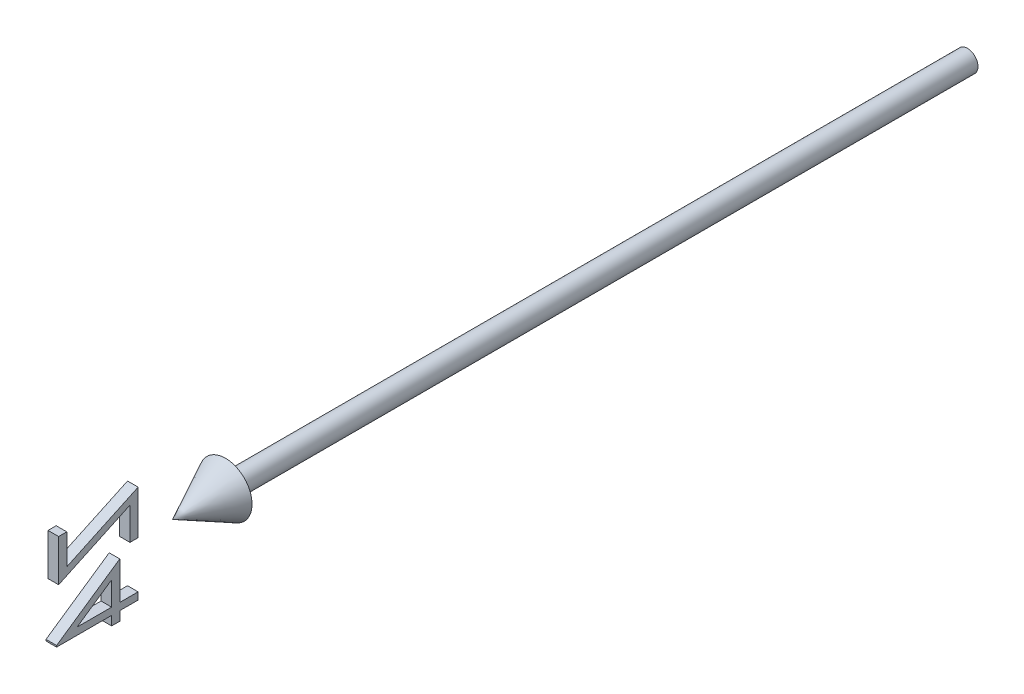
ISO-10303-21;
HEADER;
FILE_DESCRIPTION(('STEP AP214'),'2;1');
FILE_NAME('part.step','',(''),(''),'','','');
FILE_SCHEMA(('AUTOMOTIVE_DESIGN { 1 0 10303 214 1 1 1 1 }'));
ENDSEC;
DATA;
#1=APPLICATION_CONTEXT('core data for automotive mechanical design processes');
#2=APPLICATION_PROTOCOL_DEFINITION('international standard','automotive_design',2000,#1);
#3=PRODUCT_CONTEXT('',#1,'mechanical');
#4=PRODUCT('Part','Part','',(#3));
#5=PRODUCT_RELATED_PRODUCT_CATEGORY('part','',(#4));
#6=PRODUCT_DEFINITION_FORMATION('','',#4);
#7=PRODUCT_DEFINITION_CONTEXT('part definition',#1,'design');
#8=PRODUCT_DEFINITION('design','',#6,#7);
#9=PRODUCT_DEFINITION_SHAPE('','',#8);
#10=(LENGTH_UNIT() NAMED_UNIT(*) SI_UNIT(.MILLI.,.METRE.));
#11=(NAMED_UNIT(*) PLANE_ANGLE_UNIT() SI_UNIT($,.RADIAN.));
#12=(NAMED_UNIT(*) SI_UNIT($,.STERADIAN.) SOLID_ANGLE_UNIT());
#13=UNCERTAINTY_MEASURE_WITH_UNIT(LENGTH_MEASURE(1.E-05),#10,'distance_accuracy_value','');
#14=(GEOMETRIC_REPRESENTATION_CONTEXT(3) GLOBAL_UNCERTAINTY_ASSIGNED_CONTEXT((#13)) GLOBAL_UNIT_ASSIGNED_CONTEXT((#10,
#11,#12)) REPRESENTATION_CONTEXT('',''));
#15=CARTESIAN_POINT('',(0.,0.,0.));
#16=DIRECTION('',(0.,0.,1.));
#17=DIRECTION('',(1.,0.,0.));
#18=AXIS2_PLACEMENT_3D('',#15,#16,#17);
#19=CARTESIAN_POINT('',(1.00000000000002,-0.464490401758508,160.961538461538));
#20=DIRECTION('',(0.,-0.824332768950697,-0.566105543193208));
#21=DIRECTION('',(0.,0.566105543193208,-0.824332768950697));
#22=AXIS2_PLACEMENT_3D('',#19,#20,#21);
#23=PLANE('',#22);
#24=DIRECTION('',(-1.,0.,0.));
#25=VECTOR('',#24,1.);
#26=CARTESIAN_POINT('',(1.00000000000002,-0.464490401758508,160.961538461538));
#27=LINE('',#26,#25);
#28=CARTESIAN_POINT('',(1.00000000000002,-0.464490401758508,160.961538461538));
#29=VERTEX_POINT('',#28);
#30=CARTESIAN_POINT('',(-0.999999999999976,-0.464490401758508,160.961538461538));
#31=VERTEX_POINT('',#30);
#32=EDGE_CURVE('E220',#29,#31,#27,.T.);
#33=ORIENTED_EDGE('',*,*,#32,.T.);
#34=DIRECTION('',(0.,-0.566105543193208,0.824332768950697));
#35=VECTOR('',#34,1.);
#36=CARTESIAN_POINT('',(-0.999999999999976,-0.464490401758508,160.961538461538));
#37=LINE('',#36,#35);
#38=CARTESIAN_POINT('',(-0.999999999999893,-8.65259136329697,172.884615384615));
#39=VERTEX_POINT('',#38);
#40=EDGE_CURVE('E163',#31,#39,#37,.T.);
#41=ORIENTED_EDGE('',*,*,#40,.T.);
#42=DIRECTION('',(-1.,0.,0.));
#43=VECTOR('',#42,1.);
#44=CARTESIAN_POINT('',(1.00000000000011,-8.65259136329697,172.884615384615));
#45=LINE('',#44,#43);
#46=CARTESIAN_POINT('',(1.00000000000011,-8.65259136329697,172.884615384615));
#47=VERTEX_POINT('',#46);
#48=EDGE_CURVE('E12',#47,#39,#45,.T.);
#49=ORIENTED_EDGE('',*,*,#48,.F.);
#50=DIRECTION('',(0.,-0.566105543193208,0.824332768950697));
#51=VECTOR('',#50,1.);
#52=CARTESIAN_POINT('',(1.00000000000002,-0.464490401758508,160.961538461538));
#53=LINE('',#52,#51);
#54=EDGE_CURVE('E200',#29,#47,#53,.T.);
#55=ORIENTED_EDGE('',*,*,#54,.F.);
#56=EDGE_LOOP('',(#33,#41,#49,#55));
#57=FACE_BOUND('',#56,.T.);
#58=ADVANCED_FACE('F46',(#57),#23,.F.);
#59=CARTESIAN_POINT('',(1.00000000000011,-8.65259136329697,172.884615384615));
#60=DIRECTION('',(0.,0.,-1.));
#61=DIRECTION('',(-1.,0.,0.));
#62=AXIS2_PLACEMENT_3D('',#59,#60,#61);
#63=PLANE('',#62);
#64=ORIENTED_EDGE('',*,*,#48,.T.);
#65=DIRECTION('',(0.,-1.,0.));
#66=VECTOR('',#65,1.);
#67=CARTESIAN_POINT('',(-0.999999999999893,-8.65259136329697,172.884615384615));
#68=LINE('',#67,#66);
#69=CARTESIAN_POINT('',(-0.999999999999893,-8.92602886329697,172.884615384615));
#70=VERTEX_POINT('',#69);
#71=EDGE_CURVE('E168',#39,#70,#68,.T.);
#72=ORIENTED_EDGE('',*,*,#71,.T.);
#73=DIRECTION('',(-1.,0.,0.));
#74=VECTOR('',#73,1.);
#75=CARTESIAN_POINT('',(1.00000000000011,-8.92602886329697,172.884615384615));
#76=LINE('',#75,#74);
#77=CARTESIAN_POINT('',(1.00000000000011,-8.92602886329697,172.884615384615));
#78=VERTEX_POINT('',#77);
#79=EDGE_CURVE('E53',#78,#70,#76,.T.);
#80=ORIENTED_EDGE('',*,*,#79,.F.);
#81=DIRECTION('',(0.,-1.,0.));
#82=VECTOR('',#81,1.);
#83=CARTESIAN_POINT('',(1.00000000000011,-8.65259136329697,172.884615384615));
#84=LINE('',#83,#82);
#85=EDGE_CURVE('E203',#47,#78,#84,.T.);
#86=ORIENTED_EDGE('',*,*,#85,.F.);
#87=EDGE_LOOP('',(#64,#72,#80,#86));
#88=FACE_BOUND('',#87,.T.);
#89=ADVANCED_FACE('F247',(#88),#63,.F.);
#90=CARTESIAN_POINT('',(1.00000000000011,-8.92602886329697,172.884615384615));
#91=DIRECTION('',(0.,1.,0.));
#92=DIRECTION('',(0.,0.,1.));
#93=AXIS2_PLACEMENT_3D('',#90,#91,#92);
#94=PLANE('',#93);
#95=ORIENTED_EDGE('',*,*,#79,.T.);
#96=DIRECTION('',(0.,0.,-1.));
#97=VECTOR('',#96,1.);
#98=CARTESIAN_POINT('',(-0.999999999999893,-8.92602886329697,172.884615384615));
#99=LINE('',#98,#97);
#100=CARTESIAN_POINT('',(-0.999999999999965,-8.92602886329697,162.5));
#101=VERTEX_POINT('',#100);
#102=EDGE_CURVE('E171',#70,#101,#99,.T.);
#103=ORIENTED_EDGE('',*,*,#102,.T.);
#104=DIRECTION('',(-1.,0.,0.));
#105=VECTOR('',#104,1.);
#106=CARTESIAN_POINT('',(1.00000000000003,-8.92602886329697,162.5));
#107=LINE('',#106,#105);
#108=CARTESIAN_POINT('',(1.00000000000003,-8.92602886329697,162.5));
#109=VERTEX_POINT('',#108);
#110=EDGE_CURVE('E234',#109,#101,#107,.T.);
#111=ORIENTED_EDGE('',*,*,#110,.F.);
#112=DIRECTION('',(0.,0.,-1.));
#113=VECTOR('',#112,1.);
#114=CARTESIAN_POINT('',(1.00000000000011,-8.92602886329697,172.884615384615));
#115=LINE('',#114,#113);
#116=EDGE_CURVE('E205',#78,#109,#115,.T.);
#117=ORIENTED_EDGE('',*,*,#116,.F.);
#118=EDGE_LOOP('',(#95,#103,#111,#117));
#119=FACE_BOUND('',#118,.T.);
#120=ADVANCED_FACE('F239',(#119),#94,.F.);
#121=CARTESIAN_POINT('',(1.00000000000003,-8.92602886329697,162.5));
#122=DIRECTION('',(0.,0.,-1.));
#123=DIRECTION('',(-1.,0.,0.));
#124=AXIS2_PLACEMENT_3D('',#121,#122,#123);
#125=PLANE('',#124);
#126=ORIENTED_EDGE('',*,*,#110,.T.);
#127=DIRECTION('',(0.,-1.,0.));
#128=VECTOR('',#127,1.);
#129=CARTESIAN_POINT('',(-0.999999999999965,-8.92602886329697,162.5));
#130=LINE('',#129,#128);
#131=CARTESIAN_POINT('',(-0.999999999999965,-10.6567980940662,162.5));
#132=VERTEX_POINT('',#131);
#133=EDGE_CURVE('E174',#101,#132,#130,.T.);
#134=ORIENTED_EDGE('',*,*,#133,.T.);
#135=DIRECTION('',(-1.,0.,0.));
#136=VECTOR('',#135,1.);
#137=CARTESIAN_POINT('',(1.00000000000003,-10.6567980940662,162.5));
#138=LINE('',#137,#136);
#139=CARTESIAN_POINT('',(1.00000000000003,-10.6567980940662,162.5));
#140=VERTEX_POINT('',#139);
#141=EDGE_CURVE('E232',#140,#132,#138,.T.);
#142=ORIENTED_EDGE('',*,*,#141,.F.);
#143=DIRECTION('',(0.,-1.,0.));
#144=VECTOR('',#143,1.);
#145=CARTESIAN_POINT('',(1.00000000000003,-8.92602886329697,162.5));
#146=LINE('',#145,#144);
#147=EDGE_CURVE('E207',#109,#140,#146,.T.);
#148=ORIENTED_EDGE('',*,*,#147,.F.);
#149=EDGE_LOOP('',(#126,#134,#142,#148));
#150=FACE_BOUND('',#149,.T.);
#151=ADVANCED_FACE('F280',(#150),#125,.F.);
#152=CARTESIAN_POINT('',(1.00000000000003,-10.6567980940662,162.5));
#153=DIRECTION('',(0.,1.,0.));
#154=DIRECTION('',(0.,0.,1.));
#155=AXIS2_PLACEMENT_3D('',#152,#153,#154);
#156=PLANE('',#155);
#157=ORIENTED_EDGE('',*,*,#141,.T.);
#158=DIRECTION('',(0.,0.,-1.));
#159=VECTOR('',#158,1.);
#160=CARTESIAN_POINT('',(-0.999999999999965,-10.6567980940662,162.5));
#161=LINE('',#160,#159);
#162=CARTESIAN_POINT('',(-0.999999999999976,-10.6567980940662,160.961538461538));
#163=VERTEX_POINT('',#162);
#164=EDGE_CURVE('E177',#132,#163,#161,.T.);
#165=ORIENTED_EDGE('',*,*,#164,.T.);
#166=DIRECTION('',(-1.,0.,0.));
#167=VECTOR('',#166,1.);
#168=CARTESIAN_POINT('',(1.00000000000002,-10.6567980940662,160.961538461538));
#169=LINE('',#168,#167);
#170=CARTESIAN_POINT('',(1.00000000000002,-10.6567980940662,160.961538461538));
#171=VERTEX_POINT('',#170);
#172=EDGE_CURVE('E230',#171,#163,#169,.T.);
#173=ORIENTED_EDGE('',*,*,#172,.F.);
#174=DIRECTION('',(0.,0.,-1.));
#175=VECTOR('',#174,1.);
#176=CARTESIAN_POINT('',(1.00000000000003,-10.6567980940662,162.5));
#177=LINE('',#176,#175);
#178=EDGE_CURVE('E209',#140,#171,#177,.T.);
#179=ORIENTED_EDGE('',*,*,#178,.F.);
#180=EDGE_LOOP('',(#157,#165,#173,#179));
#181=FACE_BOUND('',#180,.T.);
#182=ADVANCED_FACE('F277',(#181),#156,.F.);
#183=CARTESIAN_POINT('',(1.00000000000002,-10.6567980940662,160.961538461538));
#184=DIRECTION('',(0.,0.,1.));
#185=DIRECTION('',(1.,0.,0.));
#186=AXIS2_PLACEMENT_3D('',#183,#184,#185);
#187=PLANE('',#186);
#188=ORIENTED_EDGE('',*,*,#172,.T.);
#189=DIRECTION('',(0.,1.,0.));
#190=VECTOR('',#189,1.);
#191=CARTESIAN_POINT('',(-0.999999999999976,-10.6567980940662,160.961538461538));
#192=LINE('',#191,#190);
#193=CARTESIAN_POINT('',(-0.999999999999976,-8.92602886329697,160.961538461538));
#194=VERTEX_POINT('',#193);
#195=EDGE_CURVE('E180',#163,#194,#192,.T.);
#196=ORIENTED_EDGE('',*,*,#195,.T.);
#197=DIRECTION('',(-1.,0.,0.));
#198=VECTOR('',#197,1.);
#199=CARTESIAN_POINT('',(1.00000000000002,-8.92602886329697,160.961538461538));
#200=LINE('',#199,#198);
#201=CARTESIAN_POINT('',(1.00000000000002,-8.92602886329697,160.961538461538));
#202=VERTEX_POINT('',#201);
#203=EDGE_CURVE('E228',#202,#194,#200,.T.);
#204=ORIENTED_EDGE('',*,*,#203,.F.);
#205=DIRECTION('',(0.,1.,0.));
#206=VECTOR('',#205,1.);
#207=CARTESIAN_POINT('',(1.00000000000002,-10.6567980940662,160.961538461538));
#208=LINE('',#207,#206);
#209=EDGE_CURVE('E211',#171,#202,#208,.T.);
#210=ORIENTED_EDGE('',*,*,#209,.F.);
#211=EDGE_LOOP('',(#188,#196,#204,#210));
#212=FACE_BOUND('',#211,.T.);
#213=ADVANCED_FACE('F272',(#212),#187,.F.);
#214=CARTESIAN_POINT('',(1.00000000000002,-8.92602886329697,160.961538461538));
#215=DIRECTION('',(0.,1.,0.));
#216=DIRECTION('',(0.,0.,1.));
#217=AXIS2_PLACEMENT_3D('',#214,#215,#216);
#218=PLANE('',#217);
#219=ORIENTED_EDGE('',*,*,#203,.T.);
#220=DIRECTION('',(0.,0.,-1.));
#221=VECTOR('',#220,1.);
#222=CARTESIAN_POINT('',(-0.999999999999976,-8.92602886329697,160.961538461538));
#223=LINE('',#222,#221);
#224=CARTESIAN_POINT('',(-1.,-8.92602886329697,157.5));
#225=VERTEX_POINT('',#224);
#226=EDGE_CURVE('E183',#194,#225,#223,.T.);
#227=ORIENTED_EDGE('',*,*,#226,.T.);
#228=DIRECTION('',(-1.,0.,0.));
#229=VECTOR('',#228,1.);
#230=CARTESIAN_POINT('',(1.,-8.92602886329697,157.5));
#231=LINE('',#230,#229);
#232=CARTESIAN_POINT('',(1.,-8.92602886329697,157.5));
#233=VERTEX_POINT('',#232);
#234=EDGE_CURVE('E226',#233,#225,#231,.T.);
#235=ORIENTED_EDGE('',*,*,#234,.F.);
#236=DIRECTION('',(0.,0.,-1.));
#237=VECTOR('',#236,1.);
#238=CARTESIAN_POINT('',(1.00000000000002,-8.92602886329697,160.961538461538));
#239=LINE('',#238,#237);
#240=EDGE_CURVE('E213',#202,#233,#239,.T.);
#241=ORIENTED_EDGE('',*,*,#240,.F.);
#242=EDGE_LOOP('',(#219,#227,#235,#241));
#243=FACE_BOUND('',#242,.T.);
#244=ADVANCED_FACE('F268',(#243),#218,.F.);
#245=CARTESIAN_POINT('',(1.,-8.92602886329697,157.5));
#246=DIRECTION('',(0.,0.,1.));
#247=DIRECTION('',(1.,0.,0.));
#248=AXIS2_PLACEMENT_3D('',#245,#246,#247);
#249=PLANE('',#248);
#250=ORIENTED_EDGE('',*,*,#234,.T.);
#251=DIRECTION('',(0.,1.,0.));
#252=VECTOR('',#251,1.);
#253=CARTESIAN_POINT('',(-1.,-8.92602886329697,157.5));
#254=LINE('',#253,#252);
#255=CARTESIAN_POINT('',(-1.,-7.57987501714312,157.5));
#256=VERTEX_POINT('',#255);
#257=EDGE_CURVE('E186',#225,#256,#254,.T.);
#258=ORIENTED_EDGE('',*,*,#257,.T.);
#259=DIRECTION('',(-1.,0.,0.));
#260=VECTOR('',#259,1.);
#261=CARTESIAN_POINT('',(1.,-7.57987501714312,157.5));
#262=LINE('',#261,#260);
#263=CARTESIAN_POINT('',(1.,-7.57987501714312,157.5));
#264=VERTEX_POINT('',#263);
#265=EDGE_CURVE('E224',#264,#256,#262,.T.);
#266=ORIENTED_EDGE('',*,*,#265,.F.);
#267=DIRECTION('',(0.,1.,0.));
#268=VECTOR('',#267,1.);
#269=CARTESIAN_POINT('',(1.,-8.92602886329697,157.5));
#270=LINE('',#269,#268);
#271=EDGE_CURVE('E215',#233,#264,#270,.T.);
#272=ORIENTED_EDGE('',*,*,#271,.F.);
#273=EDGE_LOOP('',(#250,#258,#266,#272));
#274=FACE_BOUND('',#273,.T.);
#275=ADVANCED_FACE('F263',(#274),#249,.F.);
#276=CARTESIAN_POINT('',(1.,-7.57987501714312,157.5));
#277=DIRECTION('',(0.,-1.,0.));
#278=DIRECTION('',(0.,0.,-1.));
#279=AXIS2_PLACEMENT_3D('',#276,#277,#278);
#280=PLANE('',#279);
#281=ORIENTED_EDGE('',*,*,#265,.T.);
#282=DIRECTION('',(0.,0.,1.));
#283=VECTOR('',#282,1.);
#284=CARTESIAN_POINT('',(-1.,-7.57987501714312,157.5));
#285=LINE('',#284,#283);
#286=CARTESIAN_POINT('',(-0.999999999999976,-7.57987501714312,160.961538461538));
#287=VERTEX_POINT('',#286);
#288=EDGE_CURVE('E189',#256,#287,#285,.T.);
#289=ORIENTED_EDGE('',*,*,#288,.T.);
#290=DIRECTION('',(-1.,0.,0.));
#291=VECTOR('',#290,1.);
#292=CARTESIAN_POINT('',(1.00000000000002,-7.57987501714312,160.961538461538));
#293=LINE('',#292,#291);
#294=CARTESIAN_POINT('',(1.00000000000002,-7.57987501714312,160.961538461538));
#295=VERTEX_POINT('',#294);
#296=EDGE_CURVE('E222',#295,#287,#293,.T.);
#297=ORIENTED_EDGE('',*,*,#296,.F.);
#298=DIRECTION('',(0.,0.,1.));
#299=VECTOR('',#298,1.);
#300=CARTESIAN_POINT('',(1.,-7.57987501714312,157.5));
#301=LINE('',#300,#299);
#302=EDGE_CURVE('E217',#264,#295,#301,.T.);
#303=ORIENTED_EDGE('',*,*,#302,.F.);
#304=EDGE_LOOP('',(#281,#289,#297,#303));
#305=FACE_BOUND('',#304,.T.);
#306=ADVANCED_FACE('F258',(#305),#280,.F.);
#307=CARTESIAN_POINT('',(1.00000000000002,-7.57987501714312,160.961538461538));
#308=DIRECTION('',(0.,0.,1.));
#309=DIRECTION('',(1.,0.,0.));
#310=AXIS2_PLACEMENT_3D('',#307,#308,#309);
#311=PLANE('',#310);
#312=ORIENTED_EDGE('',*,*,#296,.T.);
#313=DIRECTION('',(0.,1.,0.));
#314=VECTOR('',#313,1.);
#315=CARTESIAN_POINT('',(-0.999999999999976,-7.57987501714312,160.961538461538));
#316=LINE('',#315,#314);
#317=EDGE_CURVE('E192',#287,#31,#316,.T.);
#318=ORIENTED_EDGE('',*,*,#317,.T.);
#319=ORIENTED_EDGE('',*,*,#32,.F.);
#320=DIRECTION('',(0.,1.,0.));
#321=VECTOR('',#320,1.);
#322=CARTESIAN_POINT('',(1.00000000000002,-7.57987501714312,160.961538461538));
#323=LINE('',#322,#321);
#324=EDGE_CURVE('E68',#295,#29,#323,.T.);
#325=ORIENTED_EDGE('',*,*,#324,.F.);
#326=EDGE_LOOP('',(#312,#318,#319,#325));
#327=FACE_BOUND('',#326,.T.);
#328=ADVANCED_FACE('F254',(#327),#311,.F.);
#329=CARTESIAN_POINT('',(0.9999999999989,0.,0.));
#330=DIRECTION('',(1.,0.,0.));
#331=DIRECTION('',(0.,0.,-1.));
#332=AXIS2_PLACEMENT_3D('',#329,#330,#331);
#333=PLANE('',#332);
#334=DIRECTION('',(0.,-1.,0.));
#335=VECTOR('',#334,1.);
#336=CARTESIAN_POINT('',(1.00000000000003,-3.10872117098928,162.5));
#337=LINE('',#336,#335);
#338=CARTESIAN_POINT('',(1.00000000000003,-3.10872117098928,162.5));
#339=VERTEX_POINT('',#338);
#340=CARTESIAN_POINT('',(1.00000000000003,-7.57987501714312,162.5));
#341=VERTEX_POINT('',#340);
#342=EDGE_CURVE('E195',#339,#341,#337,.T.);
#343=ORIENTED_EDGE('',*,*,#342,.T.);
#344=DIRECTION('',(0.,0.,1.));
#345=VECTOR('',#344,1.);
#346=CARTESIAN_POINT('',(1.00000000000003,-7.57987501714312,162.5));
#347=LINE('',#346,#345);
#348=CARTESIAN_POINT('',(1.00000000000008,-7.57987501714312,169.014423076923));
#349=VERTEX_POINT('',#348);
#350=EDGE_CURVE('E147',#341,#349,#347,.T.);
#351=ORIENTED_EDGE('',*,*,#350,.T.);
#352=DIRECTION('',(0.,0.565883050718715,-0.82448552013318));
#353=VECTOR('',#352,1.);
#354=CARTESIAN_POINT('',(1.00000000000008,-7.57987501714312,169.014423076923));
#355=LINE('',#354,#353);
#356=EDGE_CURVE('E60',#349,#339,#355,.T.);
#357=ORIENTED_EDGE('',*,*,#356,.T.);
#358=EDGE_LOOP('',(#343,#351,#357));
#359=FACE_BOUND('',#358,.T.);
#360=ORIENTED_EDGE('',*,*,#54,.T.);
#361=ORIENTED_EDGE('',*,*,#85,.T.);
#362=ORIENTED_EDGE('',*,*,#116,.T.);
#363=ORIENTED_EDGE('',*,*,#147,.T.);
#364=ORIENTED_EDGE('',*,*,#178,.T.);
#365=ORIENTED_EDGE('',*,*,#209,.T.);
#366=ORIENTED_EDGE('',*,*,#240,.T.);
#367=ORIENTED_EDGE('',*,*,#271,.T.);
#368=ORIENTED_EDGE('',*,*,#302,.T.);
#369=ORIENTED_EDGE('',*,*,#324,.T.);
#370=EDGE_LOOP('',(#360,#361,#362,#363,#364,#365,#366,#367,#368,#369));
#371=FACE_BOUND('',#370,.T.);
#372=ADVANCED_FACE('F282',(#359,#371),#333,.T.);
#373=CARTESIAN_POINT('',(1.00000000000003,-3.10872117098928,162.5));
#374=DIRECTION('',(0.,0.,-1.));
#375=DIRECTION('',(-1.,0.,0.));
#376=AXIS2_PLACEMENT_3D('',#373,#374,#375);
#377=PLANE('',#376);
#378=DIRECTION('',(-1.,0.,0.));
#379=VECTOR('',#378,1.);
#380=CARTESIAN_POINT('',(1.00000000000003,-3.10872117098928,162.5));
#381=LINE('',#380,#379);
#382=CARTESIAN_POINT('',(-0.999999999999965,-3.10872117098928,162.5));
#383=VERTEX_POINT('',#382);
#384=EDGE_CURVE('E156',#339,#383,#381,.T.);
#385=ORIENTED_EDGE('',*,*,#384,.T.);
#386=DIRECTION('',(0.,-1.,0.));
#387=VECTOR('',#386,1.);
#388=CARTESIAN_POINT('',(-0.999999999999965,-3.10872117098928,162.5));
#389=LINE('',#388,#387);
#390=CARTESIAN_POINT('',(-0.999999999999965,-7.57987501714312,162.5));
#391=VERTEX_POINT('',#390);
#392=EDGE_CURVE('E154',#383,#391,#389,.T.);
#393=ORIENTED_EDGE('',*,*,#392,.T.);
#394=DIRECTION('',(-1.,0.,0.));
#395=VECTOR('',#394,1.);
#396=CARTESIAN_POINT('',(1.00000000000003,-7.57987501714312,162.5));
#397=LINE('',#396,#395);
#398=EDGE_CURVE('E140',#341,#391,#397,.T.);
#399=ORIENTED_EDGE('',*,*,#398,.F.);
#400=ORIENTED_EDGE('',*,*,#342,.F.);
#401=EDGE_LOOP('',(#385,#393,#399,#400));
#402=FACE_BOUND('',#401,.T.);
#403=ADVANCED_FACE('F155',(#402),#377,.F.);
#404=CARTESIAN_POINT('',(1.00000000000008,-7.57987501714312,169.014423076923));
#405=DIRECTION('',(0.,0.82448552013318,0.565883050718715));
#406=DIRECTION('',(0.,-0.565883050718715,0.82448552013318));
#407=AXIS2_PLACEMENT_3D('',#404,#405,#406);
#408=PLANE('',#407);
#409=DIRECTION('',(-1.,0.,0.));
#410=VECTOR('',#409,1.);
#411=CARTESIAN_POINT('',(1.00000000000008,-7.57987501714312,169.014423076923));
#412=LINE('',#411,#410);
#413=CARTESIAN_POINT('',(-0.99999999999992,-7.57987501714312,169.014423076923));
#414=VERTEX_POINT('',#413);
#415=EDGE_CURVE('E151',#349,#414,#412,.T.);
#416=ORIENTED_EDGE('',*,*,#415,.T.);
#417=DIRECTION('',(0.,0.565883050718715,-0.82448552013318));
#418=VECTOR('',#417,1.);
#419=CARTESIAN_POINT('',(-0.99999999999992,-7.57987501714312,169.014423076923));
#420=LINE('',#419,#418);
#421=EDGE_CURVE('E161',#414,#383,#420,.T.);
#422=ORIENTED_EDGE('',*,*,#421,.T.);
#423=ORIENTED_EDGE('',*,*,#384,.F.);
#424=ORIENTED_EDGE('',*,*,#356,.F.);
#425=EDGE_LOOP('',(#416,#422,#423,#424));
#426=FACE_BOUND('',#425,.T.);
#427=ADVANCED_FACE('F290',(#426),#408,.F.);
#428=CARTESIAN_POINT('',(1.00000000000003,-7.57987501714312,162.5));
#429=DIRECTION('',(0.,-1.,0.));
#430=DIRECTION('',(0.,0.,-1.));
#431=AXIS2_PLACEMENT_3D('',#428,#429,#430);
#432=PLANE('',#431);
#433=ORIENTED_EDGE('',*,*,#398,.T.);
#434=DIRECTION('',(0.,0.,1.));
#435=VECTOR('',#434,1.);
#436=CARTESIAN_POINT('',(-0.999999999999965,-7.57987501714312,162.5));
#437=LINE('',#436,#435);
#438=EDGE_CURVE('E144',#391,#414,#437,.T.);
#439=ORIENTED_EDGE('',*,*,#438,.T.);
#440=ORIENTED_EDGE('',*,*,#415,.F.);
#441=ORIENTED_EDGE('',*,*,#350,.F.);
#442=EDGE_LOOP('',(#433,#439,#440,#441));
#443=FACE_BOUND('',#442,.T.);
#444=ADVANCED_FACE('F142',(#443),#432,.F.);
#445=CARTESIAN_POINT('',(-1.0000000000011,0.,0.));
#446=DIRECTION('',(1.,0.,0.));
#447=DIRECTION('',(0.,0.,-1.));
#448=AXIS2_PLACEMENT_3D('',#445,#446,#447);
#449=PLANE('',#448);
#450=ORIENTED_EDGE('',*,*,#40,.F.);
#451=ORIENTED_EDGE('',*,*,#317,.F.);
#452=ORIENTED_EDGE('',*,*,#288,.F.);
#453=ORIENTED_EDGE('',*,*,#257,.F.);
#454=ORIENTED_EDGE('',*,*,#226,.F.);
#455=ORIENTED_EDGE('',*,*,#195,.F.);
#456=ORIENTED_EDGE('',*,*,#164,.F.);
#457=ORIENTED_EDGE('',*,*,#133,.F.);
#458=ORIENTED_EDGE('',*,*,#102,.F.);
#459=ORIENTED_EDGE('',*,*,#71,.F.);
#460=EDGE_LOOP('',(#450,#451,#452,#453,#454,#455,#456,#457,#458,#459));
#461=FACE_BOUND('',#460,.T.);
#462=ORIENTED_EDGE('',*,*,#392,.F.);
#463=ORIENTED_EDGE('',*,*,#421,.F.);
#464=ORIENTED_EDGE('',*,*,#438,.F.);
#465=EDGE_LOOP('',(#462,#463,#464));
#466=FACE_BOUND('',#465,.T.);
#467=ADVANCED_FACE('F160',(#461,#466),#449,.F.);
#468=CLOSED_SHELL('',(#58,#89,#120,#151,#182,#213,#244,#275,#306,#328,#372,#403,#427,#444,#467));
#469=MANIFOLD_SOLID_BREP('B2',#468);
#470=CARTESIAN_POINT('',(1.00000000000009,3.24344229054918,170.961538461538));
#471=DIRECTION('',(0.,0.,1.));
#472=DIRECTION('',(1.,0.,0.));
#473=AXIS2_PLACEMENT_3D('',#470,#471,#472);
#474=PLANE('',#473);
#475=DIRECTION('',(-1.,0.,0.));
#476=VECTOR('',#475,1.);
#477=CARTESIAN_POINT('',(1.00000000000009,3.24344229054918,170.961538461538));
#478=LINE('',#477,#476);
#479=CARTESIAN_POINT('',(1.00000000000009,3.24344229054918,170.961538461538));
#480=VERTEX_POINT('',#479);
#481=CARTESIAN_POINT('',(-0.999999999999906,3.24344229054918,170.961538461538));
#482=VERTEX_POINT('',#481);
#483=EDGE_CURVE('E503',#480,#482,#478,.T.);
#484=ORIENTED_EDGE('',*,*,#483,.T.);
#485=DIRECTION('',(0.,1.,0.));
#486=VECTOR('',#485,1.);
#487=CARTESIAN_POINT('',(-0.999999999999906,3.24344229054918,170.961538461538));
#488=LINE('',#487,#486);
#489=CARTESIAN_POINT('',(-0.999999999999906,8.95858652131841,170.961538461538));
#490=VERTEX_POINT('',#489);
#491=EDGE_CURVE('E497',#482,#490,#488,.T.);
#492=ORIENTED_EDGE('',*,*,#491,.T.);
#493=DIRECTION('',(-1.,0.,0.));
#494=VECTOR('',#493,1.);
#495=CARTESIAN_POINT('',(1.00000000000009,8.95858652131841,170.961538461538));
#496=LINE('',#495,#494);
#497=CARTESIAN_POINT('',(1.00000000000009,8.95858652131841,170.961538461538));
#498=VERTEX_POINT('',#497);
#499=EDGE_CURVE('E44',#498,#490,#496,.T.);
#500=ORIENTED_EDGE('',*,*,#499,.F.);
#501=DIRECTION('',(0.,1.,0.));
#502=VECTOR('',#501,1.);
#503=CARTESIAN_POINT('',(1.00000000000009,3.24344229054918,170.961538461538));
#504=LINE('',#503,#502);
#505=EDGE_CURVE('E521',#480,#498,#504,.T.);
#506=ORIENTED_EDGE('',*,*,#505,.F.);
#507=EDGE_LOOP('',(#484,#492,#500,#506));
#508=FACE_BOUND('',#507,.T.);
#509=ADVANCED_FACE('F421',(#508),#474,.F.);
#510=CARTESIAN_POINT('',(1.00000000000009,8.95858652131841,170.961538461538));
#511=DIRECTION('',(0.,-1.,0.));
#512=DIRECTION('',(0.,0.,-1.));
#513=AXIS2_PLACEMENT_3D('',#510,#511,#512);
#514=PLANE('',#513);
#515=ORIENTED_EDGE('',*,*,#499,.T.);
#516=DIRECTION('',(0.,0.,1.));
#517=VECTOR('',#516,1.);
#518=CARTESIAN_POINT('',(-0.999999999999906,8.95858652131841,170.961538461538));
#519=LINE('',#518,#517);
#520=CARTESIAN_POINT('',(-0.999999999999895,8.95858652131841,172.5));
#521=VERTEX_POINT('',#520);
#522=EDGE_CURVE('E487',#490,#521,#519,.T.);
#523=ORIENTED_EDGE('',*,*,#522,.T.);
#524=DIRECTION('',(-1.,0.,0.));
#525=VECTOR('',#524,1.);
#526=CARTESIAN_POINT('',(1.0000000000001,8.95858652131841,172.5));
#527=LINE('',#526,#525);
#528=CARTESIAN_POINT('',(1.0000000000001,8.95858652131841,172.5));
#529=VERTEX_POINT('',#528);
#530=EDGE_CURVE('E428',#529,#521,#527,.T.);
#531=ORIENTED_EDGE('',*,*,#530,.F.);
#532=DIRECTION('',(0.,0.,1.));
#533=VECTOR('',#532,1.);
#534=CARTESIAN_POINT('',(1.00000000000009,8.95858652131841,170.961538461538));
#535=LINE('',#534,#533);
#536=EDGE_CURVE('E488',#498,#529,#535,.T.);
#537=ORIENTED_EDGE('',*,*,#536,.F.);
#538=EDGE_LOOP('',(#515,#523,#531,#537));
#539=FACE_BOUND('',#538,.T.);
#540=ADVANCED_FACE('F485',(#539),#514,.F.);
#541=CARTESIAN_POINT('',(1.0000000000001,8.95858652131841,172.5));
#542=DIRECTION('',(0.,0.,-1.));
#543=DIRECTION('',(-1.,0.,0.));
#544=AXIS2_PLACEMENT_3D('',#541,#542,#543);
#545=PLANE('',#544);
#546=ORIENTED_EDGE('',*,*,#530,.T.);
#547=DIRECTION('',(0.,-1.,0.));
#548=VECTOR('',#547,1.);
#549=CARTESIAN_POINT('',(-0.999999999999895,8.95858652131841,172.5));
#550=LINE('',#549,#548);
#551=CARTESIAN_POINT('',(-0.999999999999895,1.07397113670303,172.5));
#552=VERTEX_POINT('',#551);
#553=EDGE_CURVE('E501',#521,#552,#550,.T.);
#554=ORIENTED_EDGE('',*,*,#553,.T.);
#555=DIRECTION('',(-1.,0.,0.));
#556=VECTOR('',#555,1.);
#557=CARTESIAN_POINT('',(1.0000000000001,1.07397113670303,172.5));
#558=LINE('',#557,#556);
#559=CARTESIAN_POINT('',(1.0000000000001,1.07397113670303,172.5));
#560=VERTEX_POINT('',#559);
#561=EDGE_CURVE('E543',#560,#552,#558,.T.);
#562=ORIENTED_EDGE('',*,*,#561,.F.);
#563=DIRECTION('',(0.,-1.,0.));
#564=VECTOR('',#563,1.);
#565=CARTESIAN_POINT('',(1.0000000000001,8.95858652131841,172.5));
#566=LINE('',#565,#564);
#567=EDGE_CURVE('E524',#529,#560,#566,.T.);
#568=ORIENTED_EDGE('',*,*,#567,.F.);
#569=EDGE_LOOP('',(#546,#554,#562,#568));
#570=FACE_BOUND('',#569,.T.);
#571=ADVANCED_FACE('F546',(#570),#545,.F.);
#572=CARTESIAN_POINT('',(1.0000000000001,1.07397113670303,172.5));
#573=DIRECTION('',(0.,0.905924666699453,0.42343889555104));
#574=DIRECTION('',(0.,-0.42343889555104,0.905924666699454));
#575=AXIS2_PLACEMENT_3D('',#572,#573,#574);
#576=PLANE('',#575);
#577=ORIENTED_EDGE('',*,*,#561,.T.);
#578=DIRECTION('',(0.,0.42343889555104,-0.905924666699453));
#579=VECTOR('',#578,1.);
#580=CARTESIAN_POINT('',(-0.999999999999895,1.07397113670303,172.5));
#581=LINE('',#580,#579);
#582=CARTESIAN_POINT('',(-0.999999999999989,7.36603844439534,159.038461538462));
#583=VERTEX_POINT('',#582);
#584=EDGE_CURVE('E507',#552,#583,#581,.T.);
#585=ORIENTED_EDGE('',*,*,#584,.T.);
#586=DIRECTION('',(-1.,0.,0.));
#587=VECTOR('',#586,1.);
#588=CARTESIAN_POINT('',(1.00000000000001,7.36603844439534,159.038461538462));
#589=LINE('',#588,#587);
#590=CARTESIAN_POINT('',(1.00000000000001,7.36603844439534,159.038461538462));
#591=VERTEX_POINT('',#590);
#592=EDGE_CURVE('E541',#591,#583,#589,.T.);
#593=ORIENTED_EDGE('',*,*,#592,.F.);
#594=DIRECTION('',(0.,0.42343889555104,-0.905924666699453));
#595=VECTOR('',#594,1.);
#596=CARTESIAN_POINT('',(1.0000000000001,1.07397113670303,172.5));
#597=LINE('',#596,#595);
#598=EDGE_CURVE('E526',#560,#591,#597,.T.);
#599=ORIENTED_EDGE('',*,*,#598,.F.);
#600=EDGE_LOOP('',(#577,#585,#593,#599));
#601=FACE_BOUND('',#600,.T.);
#602=ADVANCED_FACE('F554',(#601),#576,.F.);
#603=CARTESIAN_POINT('',(1.00000000000001,7.36603844439534,159.038461538462));
#604=DIRECTION('',(0.,0.,-1.));
#605=DIRECTION('',(-1.,0.,0.));
#606=AXIS2_PLACEMENT_3D('',#603,#604,#605);
#607=PLANE('',#606);
#608=ORIENTED_EDGE('',*,*,#592,.T.);
#609=DIRECTION('',(0.,-1.,0.));
#610=VECTOR('',#609,1.);
#611=CARTESIAN_POINT('',(-0.999999999999989,7.36603844439534,159.038461538462));
#612=LINE('',#611,#610);
#613=CARTESIAN_POINT('',(-0.999999999999989,1.26627882901072,159.038461538462));
#614=VERTEX_POINT('',#613);
#615=EDGE_CURVE('E510',#583,#614,#612,.T.);
#616=ORIENTED_EDGE('',*,*,#615,.T.);
#617=DIRECTION('',(-1.,0.,0.));
#618=VECTOR('',#617,1.);
#619=CARTESIAN_POINT('',(1.00000000000001,1.26627882901072,159.038461538462));
#620=LINE('',#619,#618);
#621=CARTESIAN_POINT('',(1.00000000000001,1.26627882901072,159.038461538462));
#622=VERTEX_POINT('',#621);
#623=EDGE_CURVE('E539',#622,#614,#620,.T.);
#624=ORIENTED_EDGE('',*,*,#623,.F.);
#625=DIRECTION('',(0.,-1.,0.));
#626=VECTOR('',#625,1.);
#627=CARTESIAN_POINT('',(1.00000000000001,7.36603844439534,159.038461538462));
#628=LINE('',#627,#626);
#629=EDGE_CURVE('E528',#591,#622,#628,.T.);
#630=ORIENTED_EDGE('',*,*,#629,.F.);
#631=EDGE_LOOP('',(#608,#616,#624,#630));
#632=FACE_BOUND('',#631,.T.);
#633=ADVANCED_FACE('F557',(#632),#607,.F.);
#634=CARTESIAN_POINT('',(1.00000000000001,1.26627882901072,159.038461538462));
#635=DIRECTION('',(0.,1.,0.));
#636=DIRECTION('',(0.,0.,1.));
#637=AXIS2_PLACEMENT_3D('',#634,#635,#636);
#638=PLANE('',#637);
#639=ORIENTED_EDGE('',*,*,#623,.T.);
#640=DIRECTION('',(0.,0.,-1.));
#641=VECTOR('',#640,1.);
#642=CARTESIAN_POINT('',(-0.999999999999989,1.26627882901072,159.038461538462));
#643=LINE('',#642,#641);
#644=CARTESIAN_POINT('',(-1.,1.26627882901072,157.5));
#645=VERTEX_POINT('',#644);
#646=EDGE_CURVE('E513',#614,#645,#643,.T.);
#647=ORIENTED_EDGE('',*,*,#646,.T.);
#648=DIRECTION('',(-1.,0.,0.));
#649=VECTOR('',#648,1.);
#650=CARTESIAN_POINT('',(1.,1.26627882901072,157.5));
#651=LINE('',#650,#649);
#652=CARTESIAN_POINT('',(1.,1.26627882901072,157.5));
#653=VERTEX_POINT('',#652);
#654=EDGE_CURVE('E537',#653,#645,#651,.T.);
#655=ORIENTED_EDGE('',*,*,#654,.F.);
#656=DIRECTION('',(0.,0.,-1.));
#657=VECTOR('',#656,1.);
#658=CARTESIAN_POINT('',(1.00000000000001,1.26627882901072,159.038461538462));
#659=LINE('',#658,#657);
#660=EDGE_CURVE('E530',#622,#653,#659,.T.);
#661=ORIENTED_EDGE('',*,*,#660,.F.);
#662=EDGE_LOOP('',(#639,#647,#655,#661));
#663=FACE_BOUND('',#662,.T.);
#664=ADVANCED_FACE('F562',(#663),#638,.F.);
#665=CARTESIAN_POINT('',(1.,1.26627882901072,157.5));
#666=DIRECTION('',(0.,0.,1.));
#667=DIRECTION('',(1.,0.,0.));
#668=AXIS2_PLACEMENT_3D('',#665,#666,#667);
#669=PLANE('',#668);
#670=ORIENTED_EDGE('',*,*,#654,.T.);
#671=DIRECTION('',(0.,1.,0.));
#672=VECTOR('',#671,1.);
#673=CARTESIAN_POINT('',(-1.,1.26627882901072,157.5));
#674=LINE('',#673,#672);
#675=CARTESIAN_POINT('',(-1.,9.53550959824149,157.5));
#676=VERTEX_POINT('',#675);
#677=EDGE_CURVE('E516',#645,#676,#674,.T.);
#678=ORIENTED_EDGE('',*,*,#677,.T.);
#679=DIRECTION('',(-1.,0.,0.));
#680=VECTOR('',#679,1.);
#681=CARTESIAN_POINT('',(1.,9.53550959824149,157.5));
#682=LINE('',#681,#680);
#683=CARTESIAN_POINT('',(1.,9.53550959824149,157.5));
#684=VERTEX_POINT('',#683);
#685=EDGE_CURVE('E535',#684,#676,#682,.T.);
#686=ORIENTED_EDGE('',*,*,#685,.F.);
#687=DIRECTION('',(0.,1.,0.));
#688=VECTOR('',#687,1.);
#689=CARTESIAN_POINT('',(1.,1.26627882901072,157.5));
#690=LINE('',#689,#688);
#691=EDGE_CURVE('E440',#653,#684,#690,.T.);
#692=ORIENTED_EDGE('',*,*,#691,.F.);
#693=EDGE_LOOP('',(#670,#678,#686,#692));
#694=FACE_BOUND('',#693,.T.);
#695=ADVANCED_FACE('F565',(#694),#669,.F.);
#696=CARTESIAN_POINT('',(1.,9.53550959824149,157.5));
#697=DIRECTION('',(0.,-0.905924666699454,-0.423438895551039));
#698=DIRECTION('',(0.,0.423438895551039,-0.905924666699454));
#699=AXIS2_PLACEMENT_3D('',#696,#697,#698);
#700=PLANE('',#699);
#701=ORIENTED_EDGE('',*,*,#685,.T.);
#702=DIRECTION('',(0.,-0.423438895551039,0.905924666699454));
#703=VECTOR('',#702,1.);
#704=CARTESIAN_POINT('',(-1.,9.53550959824149,157.5));
#705=LINE('',#704,#703);
#706=EDGE_CURVE('E519',#676,#482,#705,.T.);
#707=ORIENTED_EDGE('',*,*,#706,.T.);
#708=ORIENTED_EDGE('',*,*,#483,.F.);
#709=DIRECTION('',(0.,-0.423438895551039,0.905924666699454));
#710=VECTOR('',#709,1.);
#711=CARTESIAN_POINT('',(1.,9.53550959824149,157.5));
#712=LINE('',#711,#710);
#713=EDGE_CURVE('E435',#684,#480,#712,.T.);
#714=ORIENTED_EDGE('',*,*,#713,.F.);
#715=EDGE_LOOP('',(#701,#707,#708,#714));
#716=FACE_BOUND('',#715,.T.);
#717=ADVANCED_FACE('F567',(#716),#700,.F.);
#718=CARTESIAN_POINT('',(0.9999999999989,0.,0.));
#719=DIRECTION('',(1.,0.,0.));
#720=DIRECTION('',(0.,0.,-1.));
#721=AXIS2_PLACEMENT_3D('',#718,#719,#720);
#722=PLANE('',#721);
#723=ORIENTED_EDGE('',*,*,#505,.T.);
#724=ORIENTED_EDGE('',*,*,#536,.T.);
#725=ORIENTED_EDGE('',*,*,#567,.T.);
#726=ORIENTED_EDGE('',*,*,#598,.T.);
#727=ORIENTED_EDGE('',*,*,#629,.T.);
#728=ORIENTED_EDGE('',*,*,#660,.T.);
#729=ORIENTED_EDGE('',*,*,#691,.T.);
#730=ORIENTED_EDGE('',*,*,#713,.T.);
#731=EDGE_LOOP('',(#723,#724,#725,#726,#727,#728,#729,#730));
#732=FACE_BOUND('',#731,.T.);
#733=ADVANCED_FACE('F549',(#732),#722,.T.);
#734=CARTESIAN_POINT('',(-1.0000000000011,0.,0.));
#735=DIRECTION('',(1.,0.,0.));
#736=DIRECTION('',(0.,0.,-1.));
#737=AXIS2_PLACEMENT_3D('',#734,#735,#736);
#738=PLANE('',#737);
#739=ORIENTED_EDGE('',*,*,#491,.F.);
#740=ORIENTED_EDGE('',*,*,#706,.F.);
#741=ORIENTED_EDGE('',*,*,#677,.F.);
#742=ORIENTED_EDGE('',*,*,#646,.F.);
#743=ORIENTED_EDGE('',*,*,#615,.F.);
#744=ORIENTED_EDGE('',*,*,#584,.F.);
#745=ORIENTED_EDGE('',*,*,#553,.F.);
#746=ORIENTED_EDGE('',*,*,#522,.F.);
#747=EDGE_LOOP('',(#739,#740,#741,#742,#743,#744,#745,#746));
#748=FACE_BOUND('',#747,.T.);
#749=ADVANCED_FACE('F495',(#748),#738,.F.);
#750=CLOSED_SHELL('',(#509,#540,#571,#602,#633,#664,#695,#717,#733,#749));
#751=MANIFOLD_SOLID_BREP('B6',#750);
#752=CARTESIAN_POINT('',(2.,0.,0.));
#753=DIRECTION('',(0.,0.,1.));
#754=DIRECTION('',(1.,0.,0.));
#755=AXIS2_PLACEMENT_3D('',#752,#753,#754);
#756=PLANE('',#755);
#757=CARTESIAN_POINT('',(0.,0.,0.));
#758=DIRECTION('',(0.,0.,-1.));
#759=DIRECTION('',(-1.,0.,0.));
#760=AXIS2_PLACEMENT_3D('',#757,#758,#759);
#761=CIRCLE('',#760,2.);
#762=CARTESIAN_POINT('',(-2.,0.,0.));
#763=VERTEX_POINT('',#762);
#764=EDGE_CURVE('E419',#763,#763,#761,.T.);
#765=ORIENTED_EDGE('',*,*,#764,.T.);
#766=EDGE_LOOP('',(#765));
#767=FACE_BOUND('',#766,.T.);
#768=ADVANCED_FACE('F649',(#767),#756,.F.);
#769=CARTESIAN_POINT('',(0.,0.,-41.9499520246458));
#770=DIRECTION('',(0.,0.,-1.));
#771=DIRECTION('',(-1.,0.,0.));
#772=AXIS2_PLACEMENT_3D('',#769,#770,#771);
#773=CYLINDRICAL_SURFACE('',#772,2.);
#774=ORIENTED_EDGE('',*,*,#764,.F.);
#775=EDGE_LOOP('',(#774));
#776=FACE_BOUND('',#775,.T.);
#777=CARTESIAN_POINT('',(0.,0.,140.));
#778=DIRECTION('',(0.,0.,-1.));
#779=DIRECTION('',(-1.,0.,0.));
#780=AXIS2_PLACEMENT_3D('',#777,#778,#779);
#781=CIRCLE('',#780,2.);
#782=CARTESIAN_POINT('',(-2.,0.,140.));
#783=VERTEX_POINT('',#782);
#784=EDGE_CURVE('E655',#783,#783,#781,.T.);
#785=ORIENTED_EDGE('',*,*,#784,.T.);
#786=EDGE_LOOP('',(#785));
#787=FACE_BOUND('',#786,.T.);
#788=ADVANCED_FACE('F666',(#776,#787),#773,.T.);
#789=CARTESIAN_POINT('',(5.00000000000002,0.,140.));
#790=DIRECTION('',(0.,0.,1.));
#791=DIRECTION('',(1.,0.,0.));
#792=AXIS2_PLACEMENT_3D('',#789,#790,#791);
#793=PLANE('',#792);
#794=ORIENTED_EDGE('',*,*,#784,.F.);
#795=EDGE_LOOP('',(#794));
#796=FACE_BOUND('',#795,.T.);
#797=CARTESIAN_POINT('',(0.,0.,140.));
#798=DIRECTION('',(0.,0.,-1.));
#799=DIRECTION('',(-1.,0.,0.));
#800=AXIS2_PLACEMENT_3D('',#797,#798,#799);
#801=CIRCLE('',#800,5.00000000000002);
#802=CARTESIAN_POINT('',(-5.00000000000002,0.,140.));
#803=VERTEX_POINT('',#802);
#804=EDGE_CURVE('E680',#803,#803,#801,.T.);
#805=ORIENTED_EDGE('',*,*,#804,.T.);
#806=EDGE_LOOP('',(#805));
#807=FACE_BOUND('',#806,.T.);
#808=ADVANCED_FACE('F660',(#796,#807),#793,.F.);
#809=CARTESIAN_POINT('',(0.,0.,150.));
#810=DIRECTION('',(0.,0.,-1.));
#811=DIRECTION('',(-1.,0.,0.));
#812=AXIS2_PLACEMENT_3D('',#809,#810,#811);
#813=CONICAL_SURFACE('',#812,0.,0.463647609000806);
#814=ORIENTED_EDGE('',*,*,#804,.F.);
#815=EDGE_LOOP('',(#814));
#816=FACE_BOUND('',#815,.T.);
#817=CARTESIAN_POINT('',(0.,0.,150.));
#818=VERTEX_POINT('',#817);
#819=VERTEX_LOOP('',#818);
#820=FACE_BOUND('',#819,.T.);
#821=ADVANCED_FACE('F658',(#816,#820),#813,.T.);
#822=CLOSED_SHELL('',(#768,#788,#808,#821));
#823=MANIFOLD_SOLID_BREP('B38',#822);
#824=ADVANCED_BREP_SHAPE_REPRESENTATION('',(#18,#469,#751,#823),#14);
#825=SHAPE_DEFINITION_REPRESENTATION(#9,#824);
ENDSEC;
END-ISO-10303-21;
